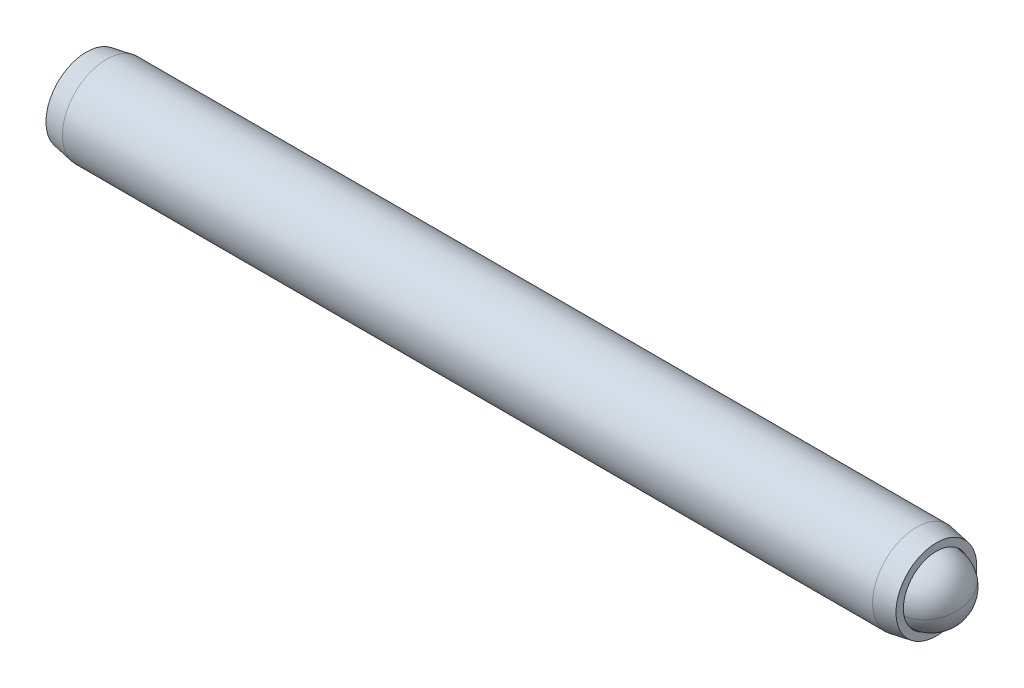
ISO-10303-21;
HEADER;
FILE_DESCRIPTION(('STEP AP214'),'2;1');
FILE_NAME('part.step','',(''),(''),'','','');
FILE_SCHEMA(('AUTOMOTIVE_DESIGN { 1 0 10303 214 1 1 1 1 }'));
ENDSEC;
DATA;
#1=APPLICATION_CONTEXT('core data for automotive mechanical design processes');
#2=APPLICATION_PROTOCOL_DEFINITION('international standard','automotive_design',2000,#1);
#3=PRODUCT_CONTEXT('',#1,'mechanical');
#4=PRODUCT('Part','Part','',(#3));
#5=PRODUCT_RELATED_PRODUCT_CATEGORY('part','',(#4));
#6=PRODUCT_DEFINITION_FORMATION('','',#4);
#7=PRODUCT_DEFINITION_CONTEXT('part definition',#1,'design');
#8=PRODUCT_DEFINITION('design','',#6,#7);
#9=PRODUCT_DEFINITION_SHAPE('','',#8);
#10=(LENGTH_UNIT() NAMED_UNIT(*) SI_UNIT(.MILLI.,.METRE.));
#11=(NAMED_UNIT(*) PLANE_ANGLE_UNIT() SI_UNIT($,.RADIAN.));
#12=(NAMED_UNIT(*) SI_UNIT($,.STERADIAN.) SOLID_ANGLE_UNIT());
#13=UNCERTAINTY_MEASURE_WITH_UNIT(LENGTH_MEASURE(1.E-05),#10,'distance_accuracy_value','');
#14=(GEOMETRIC_REPRESENTATION_CONTEXT(3) GLOBAL_UNCERTAINTY_ASSIGNED_CONTEXT((#13)) GLOBAL_UNIT_ASSIGNED_CONTEXT((#10,
#11,#12)) REPRESENTATION_CONTEXT('',''));
#15=CARTESIAN_POINT('',(0.,0.,0.));
#16=DIRECTION('',(0.,0.,1.));
#17=DIRECTION('',(1.,0.,0.));
#18=AXIS2_PLACEMENT_3D('',#15,#16,#17);
#19=CARTESIAN_POINT('',(-33.4513459470191,2.74204998828509,-0.965131231055238));
#20=DIRECTION('',(-1.,0.,0.));
#21=DIRECTION('',(0.,-1.,0.));
#22=AXIS2_PLACEMENT_3D('',#19,#20,#21);
#23=PLANE('',#22);
#24=DIRECTION('',(0.,0.866025403784438,-0.5));
#25=VECTOR('',#24,1.);
#26=CARTESIAN_POINT('',(-33.4513459470191,2.61504998828508,-2.33078112403965));
#27=LINE('',#26,#25);
#28=CARTESIAN_POINT('',(-33.4513459470191,1.49586248828508,-1.68461791964098));
#29=VERTEX_POINT('',#28);
#30=CARTESIAN_POINT('',(-33.4513459470191,2.74204998828508,-2.40410460822673));
#31=VERTEX_POINT('',#30);
#32=EDGE_CURVE('P0_E164',#29,#31,#27,.T.);
#33=ORIENTED_EDGE('',*,*,#32,.T.);
#34=DIRECTION('',(0.,0.866025403784439,0.5));
#35=VECTOR('',#34,1.);
#36=CARTESIAN_POINT('',(-33.4513459470191,3.86123748828508,-1.75794140382807));
#37=LINE('',#36,#35);
#38=CARTESIAN_POINT('',(-33.4513459470191,3.98823748828508,-1.68461791964098));
#39=VERTEX_POINT('',#38);
#40=EDGE_CURVE('P0_E166',#31,#39,#37,.T.);
#41=ORIENTED_EDGE('',*,*,#40,.T.);
#42=DIRECTION('',(0.,0.,1.));
#43=VECTOR('',#42,1.);
#44=CARTESIAN_POINT('',(-33.4513459470191,3.98823748828508,-0.392291510843657));
#45=LINE('',#44,#43);
#46=CARTESIAN_POINT('',(-33.4513459470191,3.98823748828508,-0.245644542469493));
#47=VERTEX_POINT('',#46);
#48=EDGE_CURVE('P0_E156',#39,#47,#45,.T.);
#49=ORIENTED_EDGE('',*,*,#48,.T.);
#50=DIRECTION('',(0.,-0.866025403784438,0.5));
#51=VECTOR('',#50,1.);
#52=CARTESIAN_POINT('',(-33.4513459470191,2.86904998828508,0.40051866192917));
#53=LINE('',#52,#51);
#54=CARTESIAN_POINT('',(-33.4513459470191,2.74204998828508,0.473842146116252));
#55=VERTEX_POINT('',#54);
#56=EDGE_CURVE('P0_E158',#47,#55,#53,.T.);
#57=ORIENTED_EDGE('',*,*,#56,.T.);
#58=DIRECTION('',(0.,-0.866025403784439,-0.5));
#59=VECTOR('',#58,1.);
#60=CARTESIAN_POINT('',(-33.4513459470191,1.62286248828508,-0.172321058282412));
#61=LINE('',#60,#59);
#62=CARTESIAN_POINT('',(-33.4513459470191,1.49586248828508,-0.245644542469493));
#63=VERTEX_POINT('',#62);
#64=EDGE_CURVE('P0_E160',#55,#63,#61,.T.);
#65=ORIENTED_EDGE('',*,*,#64,.T.);
#66=DIRECTION('',(0.,0.,-1.));
#67=VECTOR('',#66,1.);
#68=CARTESIAN_POINT('',(-33.4513459470191,1.49586248828508,-1.53797095126682));
#69=LINE('',#68,#67);
#70=EDGE_CURVE('P0_E162',#63,#29,#69,.T.);
#71=ORIENTED_EDGE('',*,*,#70,.T.);
#72=EDGE_LOOP('',(#33,#41,#49,#57,#65,#71));
#73=FACE_BOUND('',#72,.T.);
#74=CARTESIAN_POINT('',(-33.4513459470191,2.74204998828509,-0.965131231055238));
#75=DIRECTION('',(1.,0.,0.));
#76=DIRECTION('',(0.,1.,0.));
#77=AXIS2_PLACEMENT_3D('',#74,#75,#76);
#78=CIRCLE('',#77,2.921);
#79=CARTESIAN_POINT('',(-33.4513459470191,5.66304998828509,-0.965131231055238));
#80=VERTEX_POINT('',#79);
#81=EDGE_CURVE('P0_E150',#80,#80,#78,.T.);
#82=ORIENTED_EDGE('',*,*,#81,.F.);
#83=EDGE_LOOP('',(#82));
#84=FACE_BOUND('',#83,.T.);
#85=ADVANCED_FACE('P0_F17',(#73,#84),#23,.T.);
#86=CARTESIAN_POINT('',(-32.0108403648362,2.74204998828509,-0.965131231055238));
#87=DIRECTION('',(1.,0.,0.));
#88=DIRECTION('',(0.,1.,0.));
#89=AXIS2_PLACEMENT_3D('',#86,#87,#88);
#90=CONICAL_SURFACE('',#89,3.175,0.174532925199434);
#91=ORIENTED_EDGE('',*,*,#81,.T.);
#92=EDGE_LOOP('',(#91));
#93=FACE_BOUND('',#92,.T.);
#94=CARTESIAN_POINT('',(-32.0108403648362,2.74204998828509,-0.965131231055238));
#95=DIRECTION('',(1.,0.,0.));
#96=DIRECTION('',(0.,1.,0.));
#97=AXIS2_PLACEMENT_3D('',#94,#95,#96);
#98=CIRCLE('',#97,3.175);
#99=CARTESIAN_POINT('',(-32.0108403648362,5.91704998828509,-0.965131231055238));
#100=VERTEX_POINT('',#99);
#101=EDGE_CURVE('P0_E147',#100,#100,#98,.T.);
#102=ORIENTED_EDGE('',*,*,#101,.F.);
#103=EDGE_LOOP('',(#102));
#104=FACE_BOUND('',#103,.T.);
#105=ADVANCED_FACE('P0_F225',(#93,#104),#90,.T.);
#106=CARTESIAN_POINT('',(24.29980800758,2.7420499882851,-0.965131231055238));
#107=DIRECTION('',(1.,0.,0.));
#108=DIRECTION('',(0.,1.,0.));
#109=AXIS2_PLACEMENT_3D('',#106,#107,#108);
#110=CYLINDRICAL_SURFACE('',#109,3.175);
#111=ORIENTED_EDGE('',*,*,#101,.T.);
#112=EDGE_LOOP('',(#111));
#113=FACE_BOUND('',#112,.T.);
#114=CARTESIAN_POINT('',(26.576148470798,2.7420499882851,-0.965131231055238));
#115=DIRECTION('',(1.,0.,0.));
#116=DIRECTION('',(0.,1.,0.));
#117=AXIS2_PLACEMENT_3D('',#114,#115,#116);
#118=CIRCLE('',#117,3.17499999999999);
#119=CARTESIAN_POINT('',(26.576148470798,5.91704998828509,-0.965131231055238));
#120=VERTEX_POINT('',#119);
#121=EDGE_CURVE('P0_E144',#120,#120,#118,.T.);
#122=ORIENTED_EDGE('',*,*,#121,.F.);
#123=EDGE_LOOP('',(#122));
#124=FACE_BOUND('',#123,.T.);
#125=ADVANCED_FACE('P0_F231',(#113,#124),#110,.T.);
#126=CARTESIAN_POINT('',(28.0166540529809,2.7420499882851,-0.965131231055238));
#127=DIRECTION('',(-1.,0.,0.));
#128=DIRECTION('',(0.,-1.,0.));
#129=AXIS2_PLACEMENT_3D('',#126,#127,#128);
#130=CONICAL_SURFACE('',#129,2.92099999999999,0.174532925199434);
#131=ORIENTED_EDGE('',*,*,#121,.T.);
#132=EDGE_LOOP('',(#131));
#133=FACE_BOUND('',#132,.T.);
#134=CARTESIAN_POINT('',(28.0166540529809,2.7420499882851,-0.965131231055238));
#135=DIRECTION('',(1.,0.,0.));
#136=DIRECTION('',(0.,1.,0.));
#137=AXIS2_PLACEMENT_3D('',#134,#135,#136);
#138=CIRCLE('',#137,2.92099999999999);
#139=CARTESIAN_POINT('',(28.0166540529809,5.66304998828509,-0.965131231055238));
#140=VERTEX_POINT('',#139);
#141=EDGE_CURVE('P0_E141',#140,#140,#138,.T.);
#142=ORIENTED_EDGE('',*,*,#141,.F.);
#143=EDGE_LOOP('',(#142));
#144=FACE_BOUND('',#143,.T.);
#145=ADVANCED_FACE('P0_F275',(#133,#144),#130,.T.);
#146=CARTESIAN_POINT('',(28.0166540529809,5.66304998828509,-0.965131231055238));
#147=DIRECTION('',(1.,0.,0.));
#148=DIRECTION('',(0.,1.,0.));
#149=AXIS2_PLACEMENT_3D('',#146,#147,#148);
#150=PLANE('',#149);
#151=ORIENTED_EDGE('',*,*,#141,.T.);
#152=EDGE_LOOP('',(#151));
#153=FACE_BOUND('',#152,.T.);
#154=CARTESIAN_POINT('',(28.0166540529809,2.7420499882851,-0.965131231055238));
#155=DIRECTION('',(1.,0.,0.));
#156=DIRECTION('',(0.,1.,0.));
#157=AXIS2_PLACEMENT_3D('',#154,#155,#156);
#158=CIRCLE('',#157,2.3876);
#159=CARTESIAN_POINT('',(28.0166540529809,5.1296499882851,-0.965131231055238));
#160=VERTEX_POINT('',#159);
#161=EDGE_CURVE('P0_E138',#160,#160,#158,.T.);
#162=ORIENTED_EDGE('',*,*,#161,.F.);
#163=EDGE_LOOP('',(#162));
#164=FACE_BOUND('',#163,.T.);
#165=ADVANCED_FACE('P0_F271',(#153,#164),#150,.T.);
#166=CARTESIAN_POINT('',(24.29980800758,2.7420499882851,-0.965131231055238));
#167=DIRECTION('',(1.,0.,0.));
#168=DIRECTION('',(0.,1.,0.));
#169=AXIS2_PLACEMENT_3D('',#166,#167,#168);
#170=CYLINDRICAL_SURFACE('',#169,2.3876);
#171=ORIENTED_EDGE('',*,*,#161,.T.);
#172=EDGE_LOOP('',(#171));
#173=FACE_BOUND('',#172,.T.);
#174=CARTESIAN_POINT('',(26.68740800758,2.7420499882851,-0.965131231055238));
#175=DIRECTION('',(1.,0.,0.));
#176=DIRECTION('',(0.,1.,0.));
#177=AXIS2_PLACEMENT_3D('',#174,#175,#176);
#178=CIRCLE('',#177,2.3876);
#179=CARTESIAN_POINT('',(26.68740800758,5.1296499882851,-0.965131231055238));
#180=VERTEX_POINT('',#179);
#181=EDGE_CURVE('P0_E126',#180,#180,#178,.T.);
#182=ORIENTED_EDGE('',*,*,#181,.F.);
#183=EDGE_LOOP('',(#182));
#184=FACE_BOUND('',#183,.T.);
#185=ADVANCED_FACE('P0_F267',(#173,#184),#170,.F.);
#186=CARTESIAN_POINT('',(24.29980800758,2.7420499882851,-0.965131231055238));
#187=DIRECTION('',(1.,0.,0.));
#188=DIRECTION('',(0.,1.,0.));
#189=AXIS2_PLACEMENT_3D('',#186,#187,#188);
#190=CONICAL_SURFACE('',#189,0.,0.78539816339745);
#191=ORIENTED_EDGE('',*,*,#181,.T.);
#192=EDGE_LOOP('',(#191));
#193=FACE_BOUND('',#192,.T.);
#194=CARTESIAN_POINT('',(24.29980800758,2.7420499882851,-0.965131231055238));
#195=VERTEX_POINT('',#194);
#196=VERTEX_LOOP('',#195);
#197=FACE_BOUND('',#196,.T.);
#198=ADVANCED_FACE('P0_F221',(#193,#197),#190,.F.);
#199=CARTESIAN_POINT('',(-30.4033459470191,2.74204998828508,0.180548209367925));
#200=DIRECTION('',(0.,0.5,0.866025403784438));
#201=DIRECTION('',(0.,-0.866025403784439,0.5));
#202=AXIS2_PLACEMENT_3D('',#199,#200,#201);
#203=PLANE('',#202);
#204=DIRECTION('',(-1.,0.,0.));
#205=VECTOR('',#204,1.);
#206=CARTESIAN_POINT('',(-30.4033459470191,2.74204998828508,0.180548209367925));
#207=LINE('',#206,#205);
#208=CARTESIAN_POINT('',(-30.4033459470191,2.74204998828508,0.180548209367925));
#209=VERTEX_POINT('',#208);
#210=CARTESIAN_POINT('',(-33.1973459470191,2.74204998828508,0.180548209367925));
#211=VERTEX_POINT('',#210);
#212=EDGE_CURVE('P0_E124',#209,#211,#207,.T.);
#213=ORIENTED_EDGE('',*,*,#212,.T.);
#214=DIRECTION('',(0.,0.866025403784439,-0.5));
#215=VECTOR('',#214,1.);
#216=CARTESIAN_POINT('',(-33.1973459470191,3.73423748828508,-0.392291510843657));
#217=LINE('',#216,#215);
#218=CARTESIAN_POINT('',(-33.1973459470191,3.73423748828508,-0.392291510843657));
#219=VERTEX_POINT('',#218);
#220=EDGE_CURVE('P0_E26',#211,#219,#217,.T.);
#221=ORIENTED_EDGE('',*,*,#220,.T.);
#222=DIRECTION('',(-1.,0.,0.));
#223=VECTOR('',#222,1.);
#224=CARTESIAN_POINT('',(-30.4033459470191,3.73423748828508,-0.392291510843657));
#225=LINE('',#224,#223);
#226=CARTESIAN_POINT('',(-30.4033459470191,3.73423748828508,-0.392291510843657));
#227=VERTEX_POINT('',#226);
#228=EDGE_CURVE('P0_E90',#227,#219,#225,.T.);
#229=ORIENTED_EDGE('',*,*,#228,.F.);
#230=DIRECTION('',(0.,0.866025403784438,-0.5));
#231=VECTOR('',#230,1.);
#232=CARTESIAN_POINT('',(-30.4033459470191,2.74204998828508,0.180548209367925));
#233=LINE('',#232,#231);
#234=EDGE_CURVE('P0_E94',#209,#227,#233,.T.);
#235=ORIENTED_EDGE('',*,*,#234,.F.);
#236=EDGE_LOOP('',(#213,#221,#229,#235));
#237=FACE_BOUND('',#236,.T.);
#238=ADVANCED_FACE('P0_F92',(#237),#203,.F.);
#239=CARTESIAN_POINT('',(-30.4033459470191,1.74986248828508,-0.392291510843657));
#240=DIRECTION('',(0.,-0.5,0.866025403784439));
#241=DIRECTION('',(0.,-0.866025403784439,-0.5));
#242=AXIS2_PLACEMENT_3D('',#239,#240,#241);
#243=PLANE('',#242);
#244=DIRECTION('',(-1.,0.,0.));
#245=VECTOR('',#244,1.);
#246=CARTESIAN_POINT('',(-30.4033459470191,1.74986248828508,-0.392291510843657));
#247=LINE('',#246,#245);
#248=CARTESIAN_POINT('',(-30.4033459470191,1.74986248828508,-0.392291510843657));
#249=VERTEX_POINT('',#248);
#250=CARTESIAN_POINT('',(-33.1973459470191,1.74986248828508,-0.392291510843657));
#251=VERTEX_POINT('',#250);
#252=EDGE_CURVE('P0_E127',#249,#251,#247,.T.);
#253=ORIENTED_EDGE('',*,*,#252,.T.);
#254=DIRECTION('',(0.,0.866025403784439,0.5));
#255=VECTOR('',#254,1.);
#256=CARTESIAN_POINT('',(-33.1973459470191,2.74204998828508,0.180548209367925));
#257=LINE('',#256,#255);
#258=EDGE_CURVE('P0_E41',#251,#211,#257,.T.);
#259=ORIENTED_EDGE('',*,*,#258,.T.);
#260=ORIENTED_EDGE('',*,*,#212,.F.);
#261=DIRECTION('',(0.,0.866025403784439,0.5));
#262=VECTOR('',#261,1.);
#263=CARTESIAN_POINT('',(-30.4033459470191,1.74986248828508,-0.392291510843657));
#264=LINE('',#263,#262);
#265=EDGE_CURVE('P0_E99',#249,#209,#264,.T.);
#266=ORIENTED_EDGE('',*,*,#265,.F.);
#267=EDGE_LOOP('',(#253,#259,#260,#266));
#268=FACE_BOUND('',#267,.T.);
#269=ADVANCED_FACE('P0_F212',(#268),#243,.F.);
#270=CARTESIAN_POINT('',(-30.4033459470191,1.74986248828508,-1.53797095126682));
#271=DIRECTION('',(0.,-1.,0.));
#272=DIRECTION('',(0.,0.,-1.));
#273=AXIS2_PLACEMENT_3D('',#270,#271,#272);
#274=PLANE('',#273);
#275=DIRECTION('',(-1.,0.,0.));
#276=VECTOR('',#275,1.);
#277=CARTESIAN_POINT('',(-30.4033459470191,1.74986248828508,-1.53797095126682));
#278=LINE('',#277,#276);
#279=CARTESIAN_POINT('',(-30.4033459470191,1.74986248828508,-1.53797095126682));
#280=VERTEX_POINT('',#279);
#281=CARTESIAN_POINT('',(-33.1973459470191,1.74986248828508,-1.53797095126682));
#282=VERTEX_POINT('',#281);
#283=EDGE_CURVE('P0_E129',#280,#282,#278,.T.);
#284=ORIENTED_EDGE('',*,*,#283,.T.);
#285=DIRECTION('',(0.,0.,1.));
#286=VECTOR('',#285,1.);
#287=CARTESIAN_POINT('',(-33.1973459470191,1.74986248828508,-0.392291510843657));
#288=LINE('',#287,#286);
#289=EDGE_CURVE('P0_E171',#282,#251,#288,.T.);
#290=ORIENTED_EDGE('',*,*,#289,.T.);
#291=ORIENTED_EDGE('',*,*,#252,.F.);
#292=DIRECTION('',(0.,0.,1.));
#293=VECTOR('',#292,1.);
#294=CARTESIAN_POINT('',(-30.4033459470191,1.74986248828508,-1.53797095126682));
#295=LINE('',#294,#293);
#296=EDGE_CURVE('P0_E121',#280,#249,#295,.T.);
#297=ORIENTED_EDGE('',*,*,#296,.F.);
#298=EDGE_LOOP('',(#284,#290,#291,#297));
#299=FACE_BOUND('',#298,.T.);
#300=ADVANCED_FACE('P0_F211',(#299),#274,.F.);
#301=CARTESIAN_POINT('',(-30.4033459470191,2.74204998828508,-2.1108106714784));
#302=DIRECTION('',(0.,-0.5,-0.866025403784438));
#303=DIRECTION('',(0.,0.866025403784439,-0.5));
#304=AXIS2_PLACEMENT_3D('',#301,#302,#303);
#305=PLANE('',#304);
#306=DIRECTION('',(-1.,0.,0.));
#307=VECTOR('',#306,1.);
#308=CARTESIAN_POINT('',(-30.4033459470191,2.74204998828508,-2.1108106714784));
#309=LINE('',#308,#307);
#310=CARTESIAN_POINT('',(-30.4033459470191,2.74204998828508,-2.1108106714784));
#311=VERTEX_POINT('',#310);
#312=CARTESIAN_POINT('',(-33.1973459470191,2.74204998828508,-2.1108106714784));
#313=VERTEX_POINT('',#312);
#314=EDGE_CURVE('P0_E132',#311,#313,#309,.T.);
#315=ORIENTED_EDGE('',*,*,#314,.T.);
#316=DIRECTION('',(0.,-0.866025403784439,0.5));
#317=VECTOR('',#316,1.);
#318=CARTESIAN_POINT('',(-33.1973459470191,1.74986248828508,-1.53797095126682));
#319=LINE('',#318,#317);
#320=EDGE_CURVE('P0_E169',#313,#282,#319,.T.);
#321=ORIENTED_EDGE('',*,*,#320,.T.);
#322=ORIENTED_EDGE('',*,*,#283,.F.);
#323=DIRECTION('',(0.,-0.866025403784438,0.5));
#324=VECTOR('',#323,1.);
#325=CARTESIAN_POINT('',(-30.4033459470191,2.74204998828508,-2.1108106714784));
#326=LINE('',#325,#324);
#327=EDGE_CURVE('P0_E118',#311,#280,#326,.T.);
#328=ORIENTED_EDGE('',*,*,#327,.F.);
#329=EDGE_LOOP('',(#315,#321,#322,#328));
#330=FACE_BOUND('',#329,.T.);
#331=ADVANCED_FACE('P0_F208',(#330),#305,.F.);
#332=CARTESIAN_POINT('',(-30.4033459470191,3.73423748828508,-1.53797095126682));
#333=DIRECTION('',(0.,0.5,-0.866025403784439));
#334=DIRECTION('',(0.,0.866025403784439,0.5));
#335=AXIS2_PLACEMENT_3D('',#332,#333,#334);
#336=PLANE('',#335);
#337=DIRECTION('',(-1.,0.,0.));
#338=VECTOR('',#337,1.);
#339=CARTESIAN_POINT('',(-30.4033459470191,3.73423748828508,-1.53797095126682));
#340=LINE('',#339,#338);
#341=CARTESIAN_POINT('',(-30.4033459470191,3.73423748828508,-1.53797095126682));
#342=VERTEX_POINT('',#341);
#343=CARTESIAN_POINT('',(-33.1973459470191,3.73423748828508,-1.53797095126682));
#344=VERTEX_POINT('',#343);
#345=EDGE_CURVE('P0_E98',#342,#344,#340,.T.);
#346=ORIENTED_EDGE('',*,*,#345,.T.);
#347=DIRECTION('',(0.,-0.866025403784439,-0.5));
#348=VECTOR('',#347,1.);
#349=CARTESIAN_POINT('',(-33.1973459470191,2.74204998828508,-2.1108106714784));
#350=LINE('',#349,#348);
#351=EDGE_CURVE('P0_E153',#344,#313,#350,.T.);
#352=ORIENTED_EDGE('',*,*,#351,.T.);
#353=ORIENTED_EDGE('',*,*,#314,.F.);
#354=DIRECTION('',(0.,-0.866025403784439,-0.5));
#355=VECTOR('',#354,1.);
#356=CARTESIAN_POINT('',(-30.4033459470191,3.73423748828508,-1.53797095126682));
#357=LINE('',#356,#355);
#358=EDGE_CURVE('P0_E108',#342,#311,#357,.T.);
#359=ORIENTED_EDGE('',*,*,#358,.F.);
#360=EDGE_LOOP('',(#346,#352,#353,#359));
#361=FACE_BOUND('',#360,.T.);
#362=ADVANCED_FACE('P0_F204',(#361),#336,.F.);
#363=CARTESIAN_POINT('',(-30.4033459470191,3.73423748828508,-0.392291510843657));
#364=DIRECTION('',(0.,1.,0.));
#365=DIRECTION('',(-1.,0.,0.));
#366=AXIS2_PLACEMENT_3D('',#363,#364,#365);
#367=PLANE('',#366);
#368=ORIENTED_EDGE('',*,*,#228,.T.);
#369=DIRECTION('',(0.,0.,-1.));
#370=VECTOR('',#369,1.);
#371=CARTESIAN_POINT('',(-33.1973459470191,3.73423748828508,-1.53797095126682));
#372=LINE('',#371,#370);
#373=EDGE_CURVE('P0_E11',#219,#344,#372,.T.);
#374=ORIENTED_EDGE('',*,*,#373,.T.);
#375=ORIENTED_EDGE('',*,*,#345,.F.);
#376=DIRECTION('',(0.,0.,-1.));
#377=VECTOR('',#376,1.);
#378=CARTESIAN_POINT('',(-30.4033459470191,3.73423748828508,-0.392291510843657));
#379=LINE('',#378,#377);
#380=EDGE_CURVE('P0_E102',#227,#342,#379,.T.);
#381=ORIENTED_EDGE('',*,*,#380,.F.);
#382=EDGE_LOOP('',(#368,#374,#375,#381));
#383=FACE_BOUND('',#382,.T.);
#384=ADVANCED_FACE('P0_F103',(#383),#367,.F.);
#385=CARTESIAN_POINT('',(-30.4033459470191,4.72642498828508,-0.965131231055239));
#386=DIRECTION('',(-1.,0.,0.));
#387=DIRECTION('',(0.,0.,1.));
#388=AXIS2_PLACEMENT_3D('',#385,#386,#387);
#389=PLANE('',#388);
#390=ORIENTED_EDGE('',*,*,#234,.T.);
#391=ORIENTED_EDGE('',*,*,#380,.T.);
#392=ORIENTED_EDGE('',*,*,#358,.T.);
#393=ORIENTED_EDGE('',*,*,#327,.T.);
#394=ORIENTED_EDGE('',*,*,#296,.T.);
#395=ORIENTED_EDGE('',*,*,#265,.T.);
#396=EDGE_LOOP('',(#390,#391,#392,#393,#394,#395));
#397=FACE_BOUND('',#396,.T.);
#398=ADVANCED_FACE('P0_F110',(#397),#389,.T.);
#399=CARTESIAN_POINT('',(-33.1973459470191,1.74986248828508,-0.392291510843657));
#400=DIRECTION('',(-0.707106781186548,0.353553390593273,-0.612372435695795));
#401=DIRECTION('',(-0.654653670707977,0.,0.755928946018455));
#402=AXIS2_PLACEMENT_3D('',#399,#400,#401);
#403=PLANE('',#402);
#404=DIRECTION('',(-0.654653670707977,-0.654653670707977,0.377964473009228));
#405=VECTOR('',#404,1.);
#406=CARTESIAN_POINT('',(-32.913863804162,2.03334463114222,-0.555960002332681));
#407=LINE('',#406,#405);
#408=EDGE_CURVE('P0_E115',#63,#251,#407,.F.);
#409=ORIENTED_EDGE('',*,*,#408,.F.);
#410=ORIENTED_EDGE('',*,*,#64,.F.);
#411=DIRECTION('',(-0.654653670707977,0.,0.755928946018455));
#412=VECTOR('',#411,1.);
#413=CARTESIAN_POINT('',(-32.913863804162,2.74204998828508,-0.146788773610123));
#414=LINE('',#413,#412);
#415=EDGE_CURVE('P0_E21',#211,#55,#414,.T.);
#416=ORIENTED_EDGE('',*,*,#415,.F.);
#417=ORIENTED_EDGE('',*,*,#258,.F.);
#418=EDGE_LOOP('',(#409,#410,#416,#417));
#419=FACE_BOUND('',#418,.T.);
#420=ADVANCED_FACE('P0_F19',(#419),#403,.T.);
#421=CARTESIAN_POINT('',(-33.1973459470191,2.74204998828508,0.180548209367925));
#422=DIRECTION('',(-0.707106781186548,-0.353553390593274,-0.612372435695794));
#423=DIRECTION('',(-0.654653670707977,0.,0.755928946018455));
#424=AXIS2_PLACEMENT_3D('',#421,#422,#423);
#425=PLANE('',#424);
#426=ORIENTED_EDGE('',*,*,#415,.T.);
#427=ORIENTED_EDGE('',*,*,#56,.F.);
#428=DIRECTION('',(-0.654653670707977,0.654653670707977,0.377964473009228));
#429=VECTOR('',#428,1.);
#430=CARTESIAN_POINT('',(-32.913863804162,3.45075534542794,-0.55596000233268));
#431=LINE('',#430,#429);
#432=EDGE_CURVE('P0_E182',#219,#47,#431,.T.);
#433=ORIENTED_EDGE('',*,*,#432,.F.);
#434=ORIENTED_EDGE('',*,*,#220,.F.);
#435=EDGE_LOOP('',(#426,#427,#433,#434));
#436=FACE_BOUND('',#435,.T.);
#437=ADVANCED_FACE('P0_F196',(#436),#425,.T.);
#438=CARTESIAN_POINT('',(-33.1973459470191,1.74986248828508,-1.53797095126682));
#439=DIRECTION('',(-0.707106781186547,0.707106781186548,0.));
#440=DIRECTION('',(-0.707106781186548,-0.707106781186547,0.));
#441=AXIS2_PLACEMENT_3D('',#438,#439,#440);
#442=PLANE('',#441);
#443=ORIENTED_EDGE('',*,*,#408,.T.);
#444=ORIENTED_EDGE('',*,*,#289,.F.);
#445=DIRECTION('',(-0.654653670707977,-0.654653670707977,-0.377964473009228));
#446=VECTOR('',#445,1.);
#447=CARTESIAN_POINT('',(-32.913863804162,2.03334463114222,-1.3743024597778));
#448=LINE('',#447,#446);
#449=EDGE_CURVE('P0_E179',#29,#282,#448,.F.);
#450=ORIENTED_EDGE('',*,*,#449,.F.);
#451=ORIENTED_EDGE('',*,*,#70,.F.);
#452=EDGE_LOOP('',(#443,#444,#450,#451));
#453=FACE_BOUND('',#452,.T.);
#454=ADVANCED_FACE('P0_F189',(#453),#442,.T.);
#455=CARTESIAN_POINT('',(-33.1973459470191,3.73423748828508,-0.392291510843657));
#456=DIRECTION('',(-0.707106781186548,-0.707106781186548,0.));
#457=DIRECTION('',(0.707106781186548,-0.707106781186548,0.));
#458=AXIS2_PLACEMENT_3D('',#455,#456,#457);
#459=PLANE('',#458);
#460=ORIENTED_EDGE('',*,*,#432,.T.);
#461=ORIENTED_EDGE('',*,*,#48,.F.);
#462=DIRECTION('',(0.654653670707977,-0.654653670707977,0.377964473009228));
#463=VECTOR('',#462,1.);
#464=CARTESIAN_POINT('',(-33.1973459470191,3.73423748828508,-1.53797095126682));
#465=LINE('',#464,#463);
#466=EDGE_CURVE('P0_E177',#344,#39,#465,.F.);
#467=ORIENTED_EDGE('',*,*,#466,.F.);
#468=ORIENTED_EDGE('',*,*,#373,.F.);
#469=EDGE_LOOP('',(#460,#461,#467,#468));
#470=FACE_BOUND('',#469,.T.);
#471=ADVANCED_FACE('P0_F201',(#470),#459,.T.);
#472=CARTESIAN_POINT('',(-33.1973459470191,2.74204998828508,-2.1108106714784));
#473=DIRECTION('',(-0.707106781186548,0.353553390593274,0.612372435695794));
#474=DIRECTION('',(0.654653670707977,0.,0.755928946018455));
#475=AXIS2_PLACEMENT_3D('',#472,#473,#474);
#476=PLANE('',#475);
#477=ORIENTED_EDGE('',*,*,#449,.T.);
#478=ORIENTED_EDGE('',*,*,#320,.F.);
#479=DIRECTION('',(-0.654653670707977,0.,-0.755928946018455));
#480=VECTOR('',#479,1.);
#481=CARTESIAN_POINT('',(-32.913863804162,2.74204998828508,-1.78347368850036));
#482=LINE('',#481,#480);
#483=EDGE_CURVE('P0_E175',#31,#313,#482,.F.);
#484=ORIENTED_EDGE('',*,*,#483,.F.);
#485=ORIENTED_EDGE('',*,*,#32,.F.);
#486=EDGE_LOOP('',(#477,#478,#484,#485));
#487=FACE_BOUND('',#486,.T.);
#488=ADVANCED_FACE('P0_F240',(#487),#476,.T.);
#489=CARTESIAN_POINT('',(-33.1973459470191,3.73423748828508,-1.53797095126682));
#490=DIRECTION('',(-0.707106781186548,-0.353553390593274,0.612372435695795));
#491=DIRECTION('',(0.654653670707977,0.,0.755928946018455));
#492=AXIS2_PLACEMENT_3D('',#489,#490,#491);
#493=PLANE('',#492);
#494=ORIENTED_EDGE('',*,*,#466,.T.);
#495=ORIENTED_EDGE('',*,*,#40,.F.);
#496=ORIENTED_EDGE('',*,*,#483,.T.);
#497=ORIENTED_EDGE('',*,*,#351,.F.);
#498=EDGE_LOOP('',(#494,#495,#496,#497));
#499=FACE_BOUND('',#498,.T.);
#500=ADVANCED_FACE('P0_F237',(#499),#493,.T.);
#501=CLOSED_SHELL('',(#85,#105,#125,#145,#165,#185,#198,#238,#269,#300,#331,#362,#384,#398,#420,
#437,#454,#471,#488,#500));
#502=MANIFOLD_SOLID_BREP('P0_B1',#501);
#503=CARTESIAN_POINT('',(27.6674040529809,2.74204998828509,-0.965131231055239));
#504=DIRECTION('',(0.,0.972214232741158,0.234092899626454));
#505=DIRECTION('',(0.,0.234092899626454,-0.972214232741158));
#506=AXIS2_PLACEMENT_3D('',#503,#504,#505);
#507=SPHERICAL_SURFACE('',#506,2.38125);
#508=CARTESIAN_POINT('',(27.6674040529809,2.74204998828509,-0.965131231055239));
#509=DIRECTION('',(1.,0.,0.));
#510=DIRECTION('',(0.,0.234092899626454,-0.972214232741158));
#511=AXIS2_PLACEMENT_3D('',#508,#509,#510);
#512=CIRCLE('',#511,2.38125);
#513=CARTESIAN_POINT('',(27.6674040529809,3.29948370552059,-3.28021637277012));
#514=VERTEX_POINT('',#513);
#515=CARTESIAN_POINT('',(27.6674040529809,2.1846162710496,1.34995391065964));
#516=VERTEX_POINT('',#515);
#517=EDGE_CURVE('P1_E33',#514,#516,#512,.T.);
#518=ORIENTED_EDGE('',*,*,#517,.T.);
#519=CARTESIAN_POINT('',(27.6674040529809,2.74204998828509,-0.965131231055239));
#520=DIRECTION('',(0.,0.972214232741158,0.234092899626454));
#521=DIRECTION('',(1.,0.,0.));
#522=AXIS2_PLACEMENT_3D('',#519,#520,#521);
#523=CIRCLE('',#522,2.38125);
#524=EDGE_CURVE('P1_E10',#516,#514,#523,.T.);
#525=ORIENTED_EDGE('',*,*,#524,.T.);
#526=EDGE_LOOP('',(#518,#525));
#527=FACE_BOUND('',#526,.T.);
#528=ADVANCED_FACE('P1_F16',(#527),#507,.T.);
#529=ORIENTED_EDGE('',*,*,#517,.F.);
#530=CARTESIAN_POINT('',(27.6674040529809,2.74204998828509,-0.965131231055239));
#531=DIRECTION('',(0.,0.972214232741158,0.234092899626454));
#532=DIRECTION('',(1.,0.,0.));
#533=AXIS2_PLACEMENT_3D('',#530,#531,#532);
#534=CIRCLE('',#533,2.38125);
#535=EDGE_CURVE('P1_E23',#514,#516,#534,.T.);
#536=ORIENTED_EDGE('',*,*,#535,.T.);
#537=EDGE_LOOP('',(#529,#536));
#538=FACE_BOUND('',#537,.T.);
#539=ADVANCED_FACE('P1_F40',(#538),#507,.T.);
#540=ORIENTED_EDGE('',*,*,#524,.F.);
#541=EDGE_CURVE('P1_E36',#516,#514,#512,.T.);
#542=ORIENTED_EDGE('',*,*,#541,.T.);
#543=EDGE_LOOP('',(#540,#542));
#544=FACE_BOUND('',#543,.T.);
#545=ADVANCED_FACE('P1_F38',(#544),#507,.T.);
#546=ORIENTED_EDGE('',*,*,#535,.F.);
#547=ORIENTED_EDGE('',*,*,#541,.F.);
#548=EDGE_LOOP('',(#546,#547));
#549=FACE_BOUND('',#548,.T.);
#550=ADVANCED_FACE('P1_F18',(#549),#507,.T.);
#551=CLOSED_SHELL('',(#528,#539,#545,#550));
#552=MANIFOLD_SOLID_BREP('P1_B1',#551);
#553=ADVANCED_BREP_SHAPE_REPRESENTATION('',(#18,#502,#552),#14);
#554=SHAPE_DEFINITION_REPRESENTATION(#9,#553);
ENDSEC;
END-ISO-10303-21;
